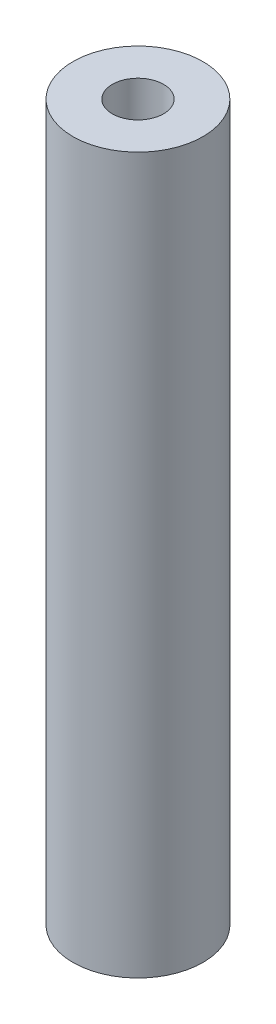
ISO-10303-21;
HEADER;
FILE_DESCRIPTION(('STEP AP214'),'2;1');
FILE_NAME('part.step','',(''),(''),'','','');
FILE_SCHEMA(('AUTOMOTIVE_DESIGN { 1 0 10303 214 1 1 1 1 }'));
ENDSEC;
DATA;
#1=APPLICATION_CONTEXT('core data for automotive mechanical design processes');
#2=APPLICATION_PROTOCOL_DEFINITION('international standard','automotive_design',2000,#1);
#3=PRODUCT_CONTEXT('',#1,'mechanical');
#4=PRODUCT('Part','Part','',(#3));
#5=PRODUCT_RELATED_PRODUCT_CATEGORY('part','',(#4));
#6=PRODUCT_DEFINITION_FORMATION('','',#4);
#7=PRODUCT_DEFINITION_CONTEXT('part definition',#1,'design');
#8=PRODUCT_DEFINITION('design','',#6,#7);
#9=PRODUCT_DEFINITION_SHAPE('','',#8);
#10=(LENGTH_UNIT() NAMED_UNIT(*) SI_UNIT(.MILLI.,.METRE.));
#11=(NAMED_UNIT(*) PLANE_ANGLE_UNIT() SI_UNIT($,.RADIAN.));
#12=(NAMED_UNIT(*) SI_UNIT($,.STERADIAN.) SOLID_ANGLE_UNIT());
#13=UNCERTAINTY_MEASURE_WITH_UNIT(LENGTH_MEASURE(1.E-05),#10,'distance_accuracy_value','');
#14=(GEOMETRIC_REPRESENTATION_CONTEXT(3) GLOBAL_UNCERTAINTY_ASSIGNED_CONTEXT((#13)) GLOBAL_UNIT_ASSIGNED_CONTEXT((#10,
#11,#12)) REPRESENTATION_CONTEXT('',''));
#15=CARTESIAN_POINT('',(0.,0.,0.));
#16=DIRECTION('',(0.,0.,1.));
#17=DIRECTION('',(1.,0.,0.));
#18=AXIS2_PLACEMENT_3D('',#15,#16,#17);
#19=CARTESIAN_POINT('',(0.,34.925,0.));
#20=DIRECTION('',(0.,-1.,0.));
#21=DIRECTION('',(0.,0.,-1.));
#22=AXIS2_PLACEMENT_3D('',#19,#20,#21);
#23=CYLINDRICAL_SURFACE('',#22,3.175);
#24=CARTESIAN_POINT('',(0.,34.925,0.));
#25=DIRECTION('',(0.,1.,0.));
#26=DIRECTION('',(0.,0.,1.));
#27=AXIS2_PLACEMENT_3D('',#24,#25,#26);
#28=CIRCLE('',#27,3.175);
#29=CARTESIAN_POINT('',(0.,34.925,3.175));
#30=VERTEX_POINT('',#29);
#31=EDGE_CURVE('E11',#30,#30,#28,.T.);
#32=ORIENTED_EDGE('',*,*,#31,.F.);
#33=EDGE_LOOP('',(#32));
#34=FACE_BOUND('',#33,.T.);
#35=CARTESIAN_POINT('',(0.,0.,0.));
#36=DIRECTION('',(0.,1.,0.));
#37=DIRECTION('',(0.,0.,1.));
#38=AXIS2_PLACEMENT_3D('',#35,#36,#37);
#39=CIRCLE('',#38,3.175);
#40=CARTESIAN_POINT('',(0.,0.,3.175));
#41=VERTEX_POINT('',#40);
#42=EDGE_CURVE('E40',#41,#41,#39,.T.);
#43=ORIENTED_EDGE('',*,*,#42,.T.);
#44=EDGE_LOOP('',(#43));
#45=FACE_BOUND('',#44,.T.);
#46=ADVANCED_FACE('F37',(#34,#45),#23,.T.);
#47=CARTESIAN_POINT('',(0.,34.925,0.));
#48=DIRECTION('',(0.,1.,0.));
#49=DIRECTION('',(0.,0.,1.));
#50=AXIS2_PLACEMENT_3D('',#47,#48,#49);
#51=PLANE('',#50);
#52=CARTESIAN_POINT('',(0.,34.925,0.));
#53=DIRECTION('',(0.,1.,0.));
#54=DIRECTION('',(0.,0.,1.));
#55=AXIS2_PLACEMENT_3D('',#52,#53,#54);
#56=CIRCLE('',#55,1.24999999999999);
#57=CARTESIAN_POINT('',(0.,34.925,1.24999999999999));
#58=VERTEX_POINT('',#57);
#59=EDGE_CURVE('E60',#58,#58,#56,.T.);
#60=ORIENTED_EDGE('',*,*,#59,.F.);
#61=EDGE_LOOP('',(#60));
#62=FACE_BOUND('',#61,.T.);
#63=ORIENTED_EDGE('',*,*,#31,.T.);
#64=EDGE_LOOP('',(#63));
#65=FACE_BOUND('',#64,.T.);
#66=ADVANCED_FACE('F79',(#62,#65),#51,.T.);
#67=CARTESIAN_POINT('',(0.,0.,0.));
#68=DIRECTION('',(0.,1.,0.));
#69=DIRECTION('',(0.,0.,1.));
#70=AXIS2_PLACEMENT_3D('',#67,#68,#69);
#71=PLANE('',#70);
#72=CARTESIAN_POINT('',(0.,0.,0.));
#73=DIRECTION('',(0.,-1.,0.));
#74=DIRECTION('',(0.,0.,-1.));
#75=AXIS2_PLACEMENT_3D('',#72,#73,#74);
#76=CIRCLE('',#75,1.24999999999999);
#77=CARTESIAN_POINT('',(0.,0.,-1.24999999999999));
#78=VERTEX_POINT('',#77);
#79=EDGE_CURVE('E61',#78,#78,#76,.T.);
#80=ORIENTED_EDGE('',*,*,#79,.F.);
#81=EDGE_LOOP('',(#80));
#82=FACE_BOUND('',#81,.T.);
#83=ORIENTED_EDGE('',*,*,#42,.F.);
#84=EDGE_LOOP('',(#83));
#85=FACE_BOUND('',#84,.T.);
#86=ADVANCED_FACE('F76',(#82,#85),#71,.F.);
#87=CARTESIAN_POINT('',(0.,22.225,0.));
#88=DIRECTION('',(0.,1.,0.));
#89=DIRECTION('',(0.,0.,1.));
#90=AXIS2_PLACEMENT_3D('',#87,#88,#89);
#91=CONICAL_SURFACE('',#90,1.25,1.02974425867665);
#92=CARTESIAN_POINT('',(0.,21.4739242262155,0.));
#93=VERTEX_POINT('',#92);
#94=VERTEX_LOOP('',#93);
#95=FACE_BOUND('',#94,.T.);
#96=CARTESIAN_POINT('',(0.,22.225,0.));
#97=DIRECTION('',(0.,1.,0.));
#98=DIRECTION('',(0.,0.,1.));
#99=AXIS2_PLACEMENT_3D('',#96,#97,#98);
#100=CIRCLE('',#99,1.25);
#101=CARTESIAN_POINT('',(0.,22.225,1.25));
#102=VERTEX_POINT('',#101);
#103=EDGE_CURVE('E64',#102,#102,#100,.T.);
#104=ORIENTED_EDGE('',*,*,#103,.T.);
#105=EDGE_LOOP('',(#104));
#106=FACE_BOUND('',#105,.T.);
#107=ADVANCED_FACE('F78',(#95,#106),#91,.F.);
#108=CARTESIAN_POINT('',(0.,34.925,0.));
#109=DIRECTION('',(0.,1.,0.));
#110=DIRECTION('',(0.,0.,1.));
#111=AXIS2_PLACEMENT_3D('',#108,#109,#110);
#112=CYLINDRICAL_SURFACE('',#111,1.24999999999999);
#113=ORIENTED_EDGE('',*,*,#103,.F.);
#114=EDGE_LOOP('',(#113));
#115=FACE_BOUND('',#114,.T.);
#116=ORIENTED_EDGE('',*,*,#59,.T.);
#117=EDGE_LOOP('',(#116));
#118=FACE_BOUND('',#117,.T.);
#119=ADVANCED_FACE('F54',(#115,#118),#112,.F.);
#120=CARTESIAN_POINT('',(0.,12.7,0.));
#121=DIRECTION('',(0.,-1.,0.));
#122=DIRECTION('',(0.,0.,-1.));
#123=AXIS2_PLACEMENT_3D('',#120,#121,#122);
#124=CONICAL_SURFACE('',#123,1.24999999999999,1.02974425867665);
#125=CARTESIAN_POINT('',(0.,13.4510757737845,0.));
#126=VERTEX_POINT('',#125);
#127=VERTEX_LOOP('',#126);
#128=FACE_BOUND('',#127,.T.);
#129=CARTESIAN_POINT('',(0.,12.7,0.));
#130=DIRECTION('',(0.,-1.,0.));
#131=DIRECTION('',(0.,0.,-1.));
#132=AXIS2_PLACEMENT_3D('',#129,#130,#131);
#133=CIRCLE('',#132,1.24999999999999);
#134=CARTESIAN_POINT('',(0.,12.7,-1.24999999999999));
#135=VERTEX_POINT('',#134);
#136=EDGE_CURVE('E58',#135,#135,#133,.T.);
#137=ORIENTED_EDGE('',*,*,#136,.T.);
#138=EDGE_LOOP('',(#137));
#139=FACE_BOUND('',#138,.T.);
#140=ADVANCED_FACE('F50',(#128,#139),#124,.F.);
#141=CARTESIAN_POINT('',(0.,0.,0.));
#142=DIRECTION('',(0.,-1.,0.));
#143=DIRECTION('',(0.,0.,-1.));
#144=AXIS2_PLACEMENT_3D('',#141,#142,#143);
#145=CYLINDRICAL_SURFACE('',#144,1.24999999999999);
#146=ORIENTED_EDGE('',*,*,#136,.F.);
#147=EDGE_LOOP('',(#146));
#148=FACE_BOUND('',#147,.T.);
#149=ORIENTED_EDGE('',*,*,#79,.T.);
#150=EDGE_LOOP('',(#149));
#151=FACE_BOUND('',#150,.T.);
#152=ADVANCED_FACE('F53',(#148,#151),#145,.F.);
#153=CLOSED_SHELL('',(#46,#66,#86,#107,#119,#140,#152));
#154=MANIFOLD_SOLID_BREP('B2',#153);
#155=ADVANCED_BREP_SHAPE_REPRESENTATION('',(#18,#154),#14);
#156=SHAPE_DEFINITION_REPRESENTATION(#9,#155);
ENDSEC;
END-ISO-10303-21;
